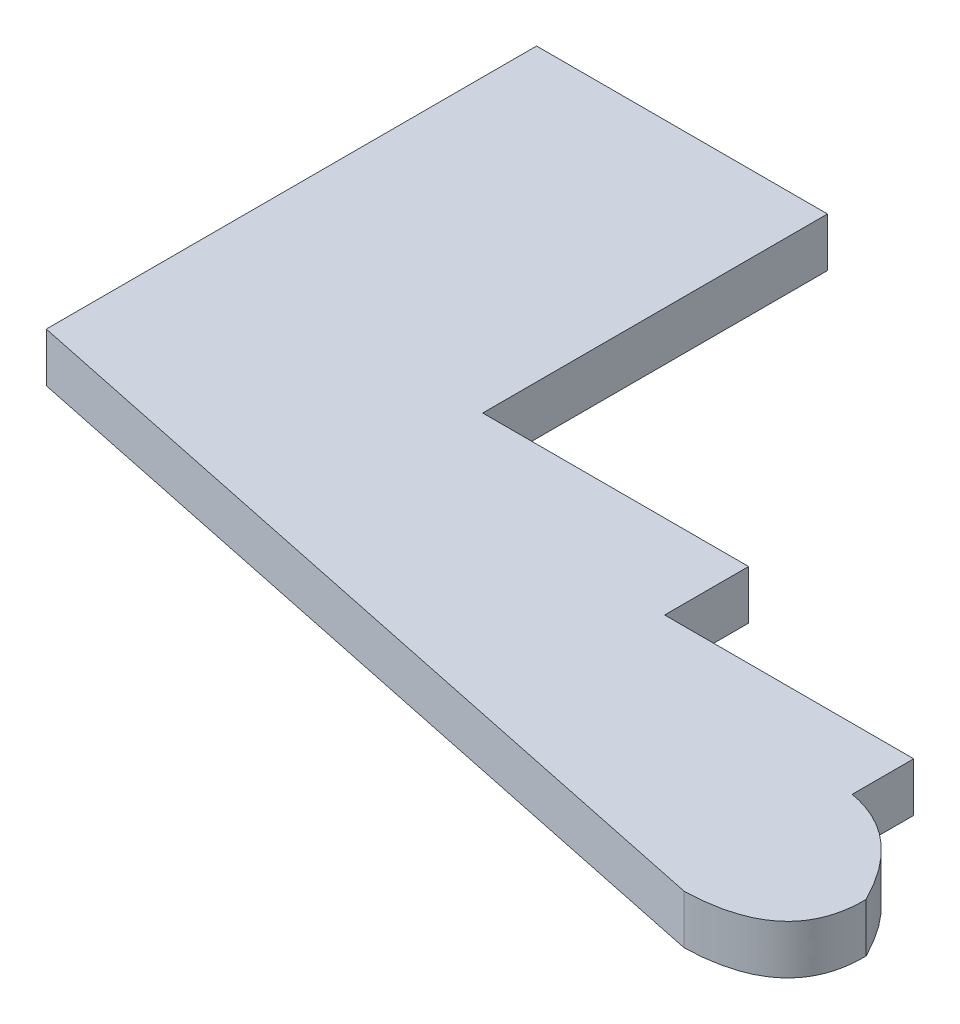
ISO-10303-21;
HEADER;
FILE_DESCRIPTION(('STEP AP214'),'2;1');
FILE_NAME('part.step','',(''),(''),'','','');
FILE_SCHEMA(('AUTOMOTIVE_DESIGN { 1 0 10303 214 1 1 1 1 }'));
ENDSEC;
DATA;
#1=APPLICATION_CONTEXT('core data for automotive mechanical design processes');
#2=APPLICATION_PROTOCOL_DEFINITION('international standard','automotive_design',2000,#1);
#3=PRODUCT_CONTEXT('',#1,'mechanical');
#4=PRODUCT('Part','Part','',(#3));
#5=PRODUCT_RELATED_PRODUCT_CATEGORY('part','',(#4));
#6=PRODUCT_DEFINITION_FORMATION('','',#4);
#7=PRODUCT_DEFINITION_CONTEXT('part definition',#1,'design');
#8=PRODUCT_DEFINITION('design','',#6,#7);
#9=PRODUCT_DEFINITION_SHAPE('','',#8);
#10=(LENGTH_UNIT() NAMED_UNIT(*) SI_UNIT(.MILLI.,.METRE.));
#11=(NAMED_UNIT(*) PLANE_ANGLE_UNIT() SI_UNIT($,.RADIAN.));
#12=(NAMED_UNIT(*) SI_UNIT($,.STERADIAN.) SOLID_ANGLE_UNIT());
#13=UNCERTAINTY_MEASURE_WITH_UNIT(LENGTH_MEASURE(1.E-05),#10,'distance_accuracy_value','');
#14=(GEOMETRIC_REPRESENTATION_CONTEXT(3) GLOBAL_UNCERTAINTY_ASSIGNED_CONTEXT((#13)) GLOBAL_UNIT_ASSIGNED_CONTEXT((#10,
#11,#12)) REPRESENTATION_CONTEXT('',''));
#15=CARTESIAN_POINT('',(0.,0.,0.));
#16=DIRECTION('',(0.,0.,1.));
#17=DIRECTION('',(1.,0.,0.));
#18=AXIS2_PLACEMENT_3D('',#15,#16,#17);
#19=CARTESIAN_POINT('',(0.,5.08,0.));
#20=DIRECTION('',(1.,0.,0.));
#21=DIRECTION('',(0.,0.,-1.));
#22=AXIS2_PLACEMENT_3D('',#19,#20,#21);
#23=PLANE('',#22);
#24=DIRECTION('',(0.,0.,1.));
#25=VECTOR('',#24,1.);
#26=CARTESIAN_POINT('',(0.,0.,0.));
#27=LINE('',#26,#25);
#28=CARTESIAN_POINT('',(0.,0.,0.));
#29=VERTEX_POINT('',#28);
#30=CARTESIAN_POINT('',(0.,0.,50.7824560426185));
#31=VERTEX_POINT('',#30);
#32=EDGE_CURVE('E141',#29,#31,#27,.T.);
#33=ORIENTED_EDGE('',*,*,#32,.T.);
#34=DIRECTION('',(0.,-1.,0.));
#35=VECTOR('',#34,1.);
#36=CARTESIAN_POINT('',(0.,5.08,50.7824560426185));
#37=LINE('',#36,#35);
#38=CARTESIAN_POINT('',(0.,5.08,50.7824560426185));
#39=VERTEX_POINT('',#38);
#40=EDGE_CURVE('E11',#39,#31,#37,.T.);
#41=ORIENTED_EDGE('',*,*,#40,.F.);
#42=DIRECTION('',(0.,0.,1.));
#43=VECTOR('',#42,1.);
#44=CARTESIAN_POINT('',(0.,5.08,0.));
#45=LINE('',#44,#43);
#46=CARTESIAN_POINT('',(0.,5.08,0.));
#47=VERTEX_POINT('',#46);
#48=EDGE_CURVE('E169',#47,#39,#45,.T.);
#49=ORIENTED_EDGE('',*,*,#48,.F.);
#50=DIRECTION('',(0.,-1.,0.));
#51=VECTOR('',#50,1.);
#52=CARTESIAN_POINT('',(0.,5.08,0.));
#53=LINE('',#52,#51);
#54=EDGE_CURVE('E137',#47,#29,#53,.T.);
#55=ORIENTED_EDGE('',*,*,#54,.T.);
#56=EDGE_LOOP('',(#33,#41,#49,#55));
#57=FACE_BOUND('',#56,.T.);
#58=ADVANCED_FACE('F33',(#57),#23,.F.);
#59=CARTESIAN_POINT('',(0.,5.08,50.7824560426185));
#60=DIRECTION('',(0.203992418788341,0.,-0.978972467987166));
#61=DIRECTION('',(-0.978972467987166,0.,-0.203992418788341));
#62=AXIS2_PLACEMENT_3D('',#59,#60,#61);
#63=PLANE('',#62);
#64=DIRECTION('',(0.978972467987166,0.,0.203992418788341));
#65=VECTOR('',#64,1.);
#66=CARTESIAN_POINT('',(0.,0.,50.7824560426185));
#67=LINE('',#66,#65);
#68=CARTESIAN_POINT('',(83.4676219060196,0.,68.1749391204398));
#69=VERTEX_POINT('',#68);
#70=EDGE_CURVE('E144',#31,#69,#67,.T.);
#71=ORIENTED_EDGE('',*,*,#70,.T.);
#72=DIRECTION('',(0.,-1.,0.));
#73=VECTOR('',#72,1.);
#74=CARTESIAN_POINT('',(83.4676219060196,5.08,68.1749391204398));
#75=LINE('',#74,#73);
#76=CARTESIAN_POINT('',(83.4676219060196,5.08,68.1749391204398));
#77=VERTEX_POINT('',#76);
#78=EDGE_CURVE('E41',#77,#69,#75,.T.);
#79=ORIENTED_EDGE('',*,*,#78,.F.);
#80=DIRECTION('',(0.978972467987166,0.,0.203992418788341));
#81=VECTOR('',#80,1.);
#82=CARTESIAN_POINT('',(0.,5.08,50.7824560426185));
#83=LINE('',#82,#81);
#84=EDGE_CURVE('E97',#39,#77,#83,.T.);
#85=ORIENTED_EDGE('',*,*,#84,.F.);
#86=ORIENTED_EDGE('',*,*,#40,.T.);
#87=EDGE_LOOP('',(#71,#79,#85,#86));
#88=FACE_BOUND('',#87,.T.);
#89=ADVANCED_FACE('F229',(#88),#63,.F.);
#90=CARTESIAN_POINT('',(83.4676219060196,5.08,68.1749391204398));
#91=CARTESIAN_POINT('',(93.7465620056765,5.08,67.9085880450148));
#92=CARTESIAN_POINT('',(93.6132370347487,5.08,59.4786975815292));
#93=B_SPLINE_CURVE_WITH_KNOTS('',2,(#90,#91,#92),.UNSPECIFIED.,.F.,.F.,(3,3),(0.,1.),.UNSPECIFIED.);
#94=DIRECTION('',(0.,-1.,0.));
#95=VECTOR('',#94,1.);
#96=SURFACE_OF_LINEAR_EXTRUSION('',#93,#95);
#97=CARTESIAN_POINT('',(83.4676219060196,0.,68.1749391204398));
#98=CARTESIAN_POINT('',(93.7465620056765,0.,67.9085880450148));
#99=CARTESIAN_POINT('',(93.6132370347487,0.,59.4786975815292));
#100=B_SPLINE_CURVE_WITH_KNOTS('',2,(#97,#98,#99),.UNSPECIFIED.,.F.,.F.,(3,3),(0.,1.),.UNSPECIFIED.);
#101=CARTESIAN_POINT('',(93.6132370347487,0.,59.4786975815292));
#102=VERTEX_POINT('',#101);
#103=EDGE_CURVE('E146',#69,#102,#100,.T.);
#104=ORIENTED_EDGE('',*,*,#103,.T.);
#105=DIRECTION('',(0.,-1.,0.));
#106=VECTOR('',#105,1.);
#107=CARTESIAN_POINT('',(93.6132370347487,5.08,59.4786975815292));
#108=LINE('',#107,#106);
#109=CARTESIAN_POINT('',(93.6132370347487,5.08,59.4786975815292));
#110=VERTEX_POINT('',#109);
#111=EDGE_CURVE('E182',#110,#102,#108,.T.);
#112=ORIENTED_EDGE('',*,*,#111,.F.);
#113=EDGE_CURVE('E190',#77,#110,#93,.T.);
#114=ORIENTED_EDGE('',*,*,#113,.F.);
#115=ORIENTED_EDGE('',*,*,#78,.T.);
#116=EDGE_LOOP('',(#104,#112,#114,#115));
#117=FACE_BOUND('',#116,.T.);
#118=ADVANCED_FACE('F188',(#117),#96,.F.);
#119=CARTESIAN_POINT('',(93.6132370347487,5.08,59.4786975815292));
#120=CARTESIAN_POINT('',(89.7540101202075,5.08,51.8499559281322));
#121=CARTESIAN_POINT('',(83.4676219060196,5.08,50.7824560426185));
#122=B_SPLINE_CURVE_WITH_KNOTS('',2,(#119,#120,#121),.UNSPECIFIED.,.F.,.F.,(3,3),(0.,
0.754491666150236),.UNSPECIFIED.);
#123=DIRECTION('',(0.,-1.,0.));
#124=VECTOR('',#123,1.);
#125=SURFACE_OF_LINEAR_EXTRUSION('',#122,#124);
#126=CARTESIAN_POINT('',(93.6132370347487,0.,59.4786975815292));
#127=CARTESIAN_POINT('',(89.7540101202075,0.,51.8499559281322));
#128=CARTESIAN_POINT('',(83.4676219060196,0.,50.7824560426185));
#129=B_SPLINE_CURVE_WITH_KNOTS('',2,(#126,#127,#128),.UNSPECIFIED.,.F.,.F.,(3,3),(0.,
0.754491666150236),.UNSPECIFIED.);
#130=CARTESIAN_POINT('',(83.4676219060196,0.,50.7824560426185));
#131=VERTEX_POINT('',#130);
#132=EDGE_CURVE('E150',#102,#131,#129,.T.);
#133=ORIENTED_EDGE('',*,*,#132,.T.);
#134=DIRECTION('',(0.,-1.,0.));
#135=VECTOR('',#134,1.);
#136=CARTESIAN_POINT('',(83.4676219060196,5.08,50.7824560426185));
#137=LINE('',#136,#135);
#138=CARTESIAN_POINT('',(83.4676219060196,5.08,50.7824560426185));
#139=VERTEX_POINT('',#138);
#140=EDGE_CURVE('E179',#139,#131,#137,.T.);
#141=ORIENTED_EDGE('',*,*,#140,.F.);
#142=EDGE_CURVE('E208',#110,#139,#122,.T.);
#143=ORIENTED_EDGE('',*,*,#142,.F.);
#144=ORIENTED_EDGE('',*,*,#111,.T.);
#145=EDGE_LOOP('',(#133,#141,#143,#144));
#146=FACE_BOUND('',#145,.T.);
#147=ADVANCED_FACE('F199',(#146),#125,.F.);
#148=CARTESIAN_POINT('',(83.4676219060196,5.08,50.7824560426185));
#149=DIRECTION('',(-1.,0.,0.));
#150=DIRECTION('',(0.,0.,1.));
#151=AXIS2_PLACEMENT_3D('',#148,#149,#150);
#152=PLANE('',#151);
#153=DIRECTION('',(0.,0.,-1.));
#154=VECTOR('',#153,1.);
#155=CARTESIAN_POINT('',(83.4676219060196,0.,50.7824560426185));
#156=LINE('',#155,#154);
#157=CARTESIAN_POINT('',(83.4676219060196,0.,44.4052122474174));
#158=VERTEX_POINT('',#157);
#159=EDGE_CURVE('E157',#131,#158,#156,.T.);
#160=ORIENTED_EDGE('',*,*,#159,.T.);
#161=DIRECTION('',(0.,-1.,0.));
#162=VECTOR('',#161,1.);
#163=CARTESIAN_POINT('',(83.4676219060196,5.08,44.4052122474174));
#164=LINE('',#163,#162);
#165=CARTESIAN_POINT('',(83.4676219060196,5.08,44.4052122474174));
#166=VERTEX_POINT('',#165);
#167=EDGE_CURVE('E176',#166,#158,#164,.T.);
#168=ORIENTED_EDGE('',*,*,#167,.F.);
#169=DIRECTION('',(0.,0.,-1.));
#170=VECTOR('',#169,1.);
#171=CARTESIAN_POINT('',(83.4676219060196,5.08,50.7824560426185));
#172=LINE('',#171,#170);
#173=EDGE_CURVE('E205',#139,#166,#172,.T.);
#174=ORIENTED_EDGE('',*,*,#173,.F.);
#175=ORIENTED_EDGE('',*,*,#140,.T.);
#176=EDGE_LOOP('',(#160,#168,#174,#175));
#177=FACE_BOUND('',#176,.T.);
#178=ADVANCED_FACE('F203',(#177),#152,.F.);
#179=CARTESIAN_POINT('',(83.4676219060196,5.08,44.4052122474174));
#180=DIRECTION('',(0.,0.,1.));
#181=DIRECTION('',(1.,0.,0.));
#182=AXIS2_PLACEMENT_3D('',#179,#180,#181);
#183=PLANE('',#182);
#184=DIRECTION('',(-1.,0.,0.));
#185=VECTOR('',#184,1.);
#186=CARTESIAN_POINT('',(83.4676219060196,0.,44.4052122474174));
#187=LINE('',#186,#185);
#188=CARTESIAN_POINT('',(57.6687720072515,0.,44.4052122474174));
#189=VERTEX_POINT('',#188);
#190=EDGE_CURVE('E162',#158,#189,#187,.T.);
#191=ORIENTED_EDGE('',*,*,#190,.T.);
#192=DIRECTION('',(0.,-1.,0.));
#193=VECTOR('',#192,1.);
#194=CARTESIAN_POINT('',(57.6687720072515,5.08,44.4052122474174));
#195=LINE('',#194,#193);
#196=CARTESIAN_POINT('',(57.6687720072515,5.08,44.4052122474174));
#197=VERTEX_POINT('',#196);
#198=EDGE_CURVE('E173',#197,#189,#195,.T.);
#199=ORIENTED_EDGE('',*,*,#198,.F.);
#200=DIRECTION('',(-1.,0.,0.));
#201=VECTOR('',#200,1.);
#202=CARTESIAN_POINT('',(83.4676219060196,5.08,44.4052122474174));
#203=LINE('',#202,#201);
#204=EDGE_CURVE('E207',#166,#197,#203,.T.);
#205=ORIENTED_EDGE('',*,*,#204,.F.);
#206=ORIENTED_EDGE('',*,*,#167,.T.);
#207=EDGE_LOOP('',(#191,#199,#205,#206));
#208=FACE_BOUND('',#207,.T.);
#209=ADVANCED_FACE('F242',(#208),#183,.F.);
#210=CARTESIAN_POINT('',(57.6687720072515,5.08,44.4052122474174));
#211=DIRECTION('',(-1.,0.,0.));
#212=DIRECTION('',(0.,0.,1.));
#213=AXIS2_PLACEMENT_3D('',#210,#211,#212);
#214=PLANE('',#213);
#215=DIRECTION('',(0.,0.,-1.));
#216=VECTOR('',#215,1.);
#217=CARTESIAN_POINT('',(57.6687720072515,0.,44.4052122474174));
#218=LINE('',#217,#216);
#219=CARTESIAN_POINT('',(57.6687720072515,0.,35.7089707085068));
#220=VERTEX_POINT('',#219);
#221=EDGE_CURVE('E164',#189,#220,#218,.T.);
#222=ORIENTED_EDGE('',*,*,#221,.T.);
#223=DIRECTION('',(0.,-1.,0.));
#224=VECTOR('',#223,1.);
#225=CARTESIAN_POINT('',(57.6687720072515,5.08,35.7089707085068));
#226=LINE('',#225,#224);
#227=CARTESIAN_POINT('',(57.6687720072515,5.08,35.7089707085068));
#228=VERTEX_POINT('',#227);
#229=EDGE_CURVE('E132',#228,#220,#226,.T.);
#230=ORIENTED_EDGE('',*,*,#229,.F.);
#231=DIRECTION('',(0.,0.,-1.));
#232=VECTOR('',#231,1.);
#233=CARTESIAN_POINT('',(57.6687720072515,5.08,44.4052122474174));
#234=LINE('',#233,#232);
#235=EDGE_CURVE('E122',#197,#228,#234,.T.);
#236=ORIENTED_EDGE('',*,*,#235,.F.);
#237=ORIENTED_EDGE('',*,*,#198,.T.);
#238=EDGE_LOOP('',(#222,#230,#236,#237));
#239=FACE_BOUND('',#238,.T.);
#240=ADVANCED_FACE('F239',(#239),#214,.F.);
#241=CARTESIAN_POINT('',(57.6687720072515,5.08,35.7089707085068));
#242=DIRECTION('',(0.,0.,1.));
#243=DIRECTION('',(1.,0.,0.));
#244=AXIS2_PLACEMENT_3D('',#241,#242,#243);
#245=PLANE('',#244);
#246=DIRECTION('',(-1.,0.,0.));
#247=VECTOR('',#246,1.);
#248=CARTESIAN_POINT('',(57.6687720072515,0.,35.7089707085068));
#249=LINE('',#248,#247);
#250=CARTESIAN_POINT('',(30.1306738007012,0.,35.7089707085068));
#251=VERTEX_POINT('',#250);
#252=EDGE_CURVE('E131',#220,#251,#249,.T.);
#253=ORIENTED_EDGE('',*,*,#252,.T.);
#254=DIRECTION('',(0.,-1.,0.));
#255=VECTOR('',#254,1.);
#256=CARTESIAN_POINT('',(30.1306738007012,5.08,35.7089707085068));
#257=LINE('',#256,#255);
#258=CARTESIAN_POINT('',(30.1306738007012,5.08,35.7089707085068));
#259=VERTEX_POINT('',#258);
#260=EDGE_CURVE('E128',#259,#251,#257,.T.);
#261=ORIENTED_EDGE('',*,*,#260,.F.);
#262=DIRECTION('',(-1.,0.,0.));
#263=VECTOR('',#262,1.);
#264=CARTESIAN_POINT('',(57.6687720072515,5.08,35.7089707085068));
#265=LINE('',#264,#263);
#266=EDGE_CURVE('E116',#228,#259,#265,.T.);
#267=ORIENTED_EDGE('',*,*,#266,.F.);
#268=ORIENTED_EDGE('',*,*,#229,.T.);
#269=EDGE_LOOP('',(#253,#261,#267,#268));
#270=FACE_BOUND('',#269,.T.);
#271=ADVANCED_FACE('F129',(#270),#245,.F.);
#272=CARTESIAN_POINT('',(30.1306738007012,5.08,29.6216016312694));
#273=DIRECTION('',(-1.,0.,0.));
#274=DIRECTION('',(0.,0.,1.));
#275=AXIS2_PLACEMENT_3D('',#272,#273,#274);
#276=PLANE('',#275);
#277=DIRECTION('',(0.,0.,-1.));
#278=VECTOR('',#277,1.);
#279=CARTESIAN_POINT('',(30.1306738007012,0.,29.6216016312694));
#280=LINE('',#279,#278);
#281=CARTESIAN_POINT('',(30.1306738007012,0.,0.));
#282=VERTEX_POINT('',#281);
#283=EDGE_CURVE('E83',#251,#282,#280,.T.);
#284=ORIENTED_EDGE('',*,*,#283,.T.);
#285=DIRECTION('',(0.,-1.,0.));
#286=VECTOR('',#285,1.);
#287=CARTESIAN_POINT('',(30.1306738007012,5.08,0.));
#288=LINE('',#287,#286);
#289=CARTESIAN_POINT('',(30.1306738007012,5.08,0.));
#290=VERTEX_POINT('',#289);
#291=EDGE_CURVE('E133',#290,#282,#288,.T.);
#292=ORIENTED_EDGE('',*,*,#291,.F.);
#293=DIRECTION('',(0.,0.,-1.));
#294=VECTOR('',#293,1.);
#295=CARTESIAN_POINT('',(30.1306738007012,5.08,35.7089707085068));
#296=LINE('',#295,#294);
#297=EDGE_CURVE('E120',#259,#290,#296,.T.);
#298=ORIENTED_EDGE('',*,*,#297,.F.);
#299=ORIENTED_EDGE('',*,*,#260,.T.);
#300=EDGE_LOOP('',(#284,#292,#298,#299));
#301=FACE_BOUND('',#300,.T.);
#302=ADVANCED_FACE('F135',(#301),#276,.F.);
#303=CARTESIAN_POINT('',(0.,5.08,0.));
#304=DIRECTION('',(0.,0.,1.));
#305=DIRECTION('',(1.,0.,0.));
#306=AXIS2_PLACEMENT_3D('',#303,#304,#305);
#307=PLANE('',#306);
#308=DIRECTION('',(-1.,0.,0.));
#309=VECTOR('',#308,1.);
#310=CARTESIAN_POINT('',(0.,0.,0.));
#311=LINE('',#310,#309);
#312=EDGE_CURVE('E89',#282,#29,#311,.T.);
#313=ORIENTED_EDGE('',*,*,#312,.T.);
#314=ORIENTED_EDGE('',*,*,#54,.F.);
#315=DIRECTION('',(-1.,0.,0.));
#316=VECTOR('',#315,1.);
#317=CARTESIAN_POINT('',(0.,5.08,0.));
#318=LINE('',#317,#316);
#319=EDGE_CURVE('E49',#290,#47,#318,.T.);
#320=ORIENTED_EDGE('',*,*,#319,.F.);
#321=ORIENTED_EDGE('',*,*,#291,.T.);
#322=EDGE_LOOP('',(#313,#314,#320,#321));
#323=FACE_BOUND('',#322,.T.);
#324=ADVANCED_FACE('F254',(#323),#307,.F.);
#325=CARTESIAN_POINT('',(91.1434957380304,5.08,65.8677031979996));
#326=DIRECTION('',(0.,-1.,0.));
#327=DIRECTION('',(0.,0.,-1.));
#328=AXIS2_PLACEMENT_3D('',#325,#326,#327);
#329=PLANE('',#328);
#330=ORIENTED_EDGE('',*,*,#48,.T.);
#331=ORIENTED_EDGE('',*,*,#84,.T.);
#332=ORIENTED_EDGE('',*,*,#113,.T.);
#333=ORIENTED_EDGE('',*,*,#142,.T.);
#334=ORIENTED_EDGE('',*,*,#173,.T.);
#335=ORIENTED_EDGE('',*,*,#204,.T.);
#336=ORIENTED_EDGE('',*,*,#235,.T.);
#337=ORIENTED_EDGE('',*,*,#266,.T.);
#338=ORIENTED_EDGE('',*,*,#297,.T.);
#339=ORIENTED_EDGE('',*,*,#319,.T.);
#340=EDGE_LOOP('',(#330,#331,#332,#333,#334,#335,#336,#337,#338,#339));
#341=FACE_BOUND('',#340,.T.);
#342=ADVANCED_FACE('F118',(#341),#329,.F.);
#343=CARTESIAN_POINT('',(91.1434957380304,0.,65.8677031979996));
#344=DIRECTION('',(0.,-1.,0.));
#345=DIRECTION('',(0.,0.,-1.));
#346=AXIS2_PLACEMENT_3D('',#343,#344,#345);
#347=PLANE('',#346);
#348=ORIENTED_EDGE('',*,*,#32,.F.);
#349=ORIENTED_EDGE('',*,*,#312,.F.);
#350=ORIENTED_EDGE('',*,*,#283,.F.);
#351=ORIENTED_EDGE('',*,*,#252,.F.);
#352=ORIENTED_EDGE('',*,*,#221,.F.);
#353=ORIENTED_EDGE('',*,*,#190,.F.);
#354=ORIENTED_EDGE('',*,*,#159,.F.);
#355=ORIENTED_EDGE('',*,*,#132,.F.);
#356=ORIENTED_EDGE('',*,*,#103,.F.);
#357=ORIENTED_EDGE('',*,*,#70,.F.);
#358=EDGE_LOOP('',(#348,#349,#350,#351,#352,#353,#354,#355,#356,#357));
#359=FACE_BOUND('',#358,.T.);
#360=ADVANCED_FACE('F194',(#359),#347,.T.);
#361=CLOSED_SHELL('',(#58,#89,#118,#147,#178,#209,#240,#271,#302,#324,#342,#360));
#362=MANIFOLD_SOLID_BREP('B2',#361);
#363=ADVANCED_BREP_SHAPE_REPRESENTATION('',(#18,#362),#14);
#364=SHAPE_DEFINITION_REPRESENTATION(#9,#363);
ENDSEC;
END-ISO-10303-21;
